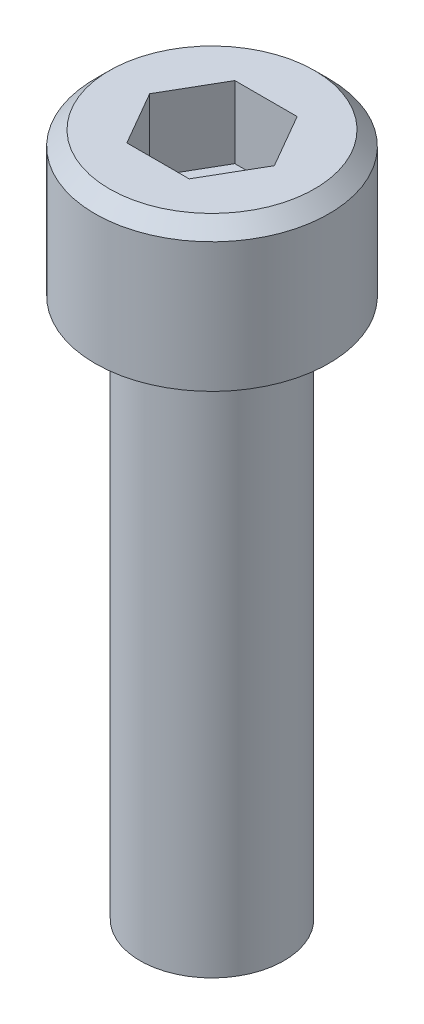
ISO-10303-21;
HEADER;
FILE_DESCRIPTION(('STEP AP214'),'2;1');
FILE_NAME('part.step','',(''),(''),'','','');
FILE_SCHEMA(('AUTOMOTIVE_DESIGN { 1 0 10303 214 1 1 1 1 }'));
ENDSEC;
DATA;
#1=APPLICATION_CONTEXT('core data for automotive mechanical design processes');
#2=APPLICATION_PROTOCOL_DEFINITION('international standard','automotive_design',2000,#1);
#3=PRODUCT_CONTEXT('',#1,'mechanical');
#4=PRODUCT('Part','Part','',(#3));
#5=PRODUCT_RELATED_PRODUCT_CATEGORY('part','',(#4));
#6=PRODUCT_DEFINITION_FORMATION('','',#4);
#7=PRODUCT_DEFINITION_CONTEXT('part definition',#1,'design');
#8=PRODUCT_DEFINITION('design','',#6,#7);
#9=PRODUCT_DEFINITION_SHAPE('','',#8);
#10=(LENGTH_UNIT() NAMED_UNIT(*) SI_UNIT(.MILLI.,.METRE.));
#11=(NAMED_UNIT(*) PLANE_ANGLE_UNIT() SI_UNIT($,.RADIAN.));
#12=(NAMED_UNIT(*) SI_UNIT($,.STERADIAN.) SOLID_ANGLE_UNIT());
#13=UNCERTAINTY_MEASURE_WITH_UNIT(LENGTH_MEASURE(1.E-05),#10,'distance_accuracy_value','');
#14=(GEOMETRIC_REPRESENTATION_CONTEXT(3) GLOBAL_UNCERTAINTY_ASSIGNED_CONTEXT((#13)) GLOBAL_UNIT_ASSIGNED_CONTEXT((#10,
#11,#12)) REPRESENTATION_CONTEXT('',''));
#15=CARTESIAN_POINT('',(0.,0.,0.));
#16=DIRECTION('',(0.,0.,1.));
#17=DIRECTION('',(1.,0.,0.));
#18=AXIS2_PLACEMENT_3D('',#15,#16,#17);
#19=CARTESIAN_POINT('',(0.,-30.,0.));
#20=DIRECTION('',(0.,-1.,0.));
#21=DIRECTION('',(0.,0.,-1.));
#22=AXIS2_PLACEMENT_3D('',#19,#20,#21);
#23=PLANE('',#22);
#24=CARTESIAN_POINT('',(0.,-30.,0.));
#25=DIRECTION('',(0.,-1.,0.));
#26=DIRECTION('',(0.,0.,-1.));
#27=AXIS2_PLACEMENT_3D('',#24,#25,#26);
#28=CIRCLE('',#27,4.);
#29=CARTESIAN_POINT('',(0.,-30.,-4.));
#30=VERTEX_POINT('',#29);
#31=EDGE_CURVE('E187',#30,#30,#28,.T.);
#32=ORIENTED_EDGE('',*,*,#31,.T.);
#33=EDGE_LOOP('',(#32));
#34=FACE_BOUND('',#33,.T.);
#35=ADVANCED_FACE('F43',(#34),#23,.T.);
#36=CARTESIAN_POINT('',(0.,0.,0.));
#37=DIRECTION('',(0.,-1.,0.));
#38=DIRECTION('',(0.,0.,-1.));
#39=AXIS2_PLACEMENT_3D('',#36,#37,#38);
#40=CYLINDRICAL_SURFACE('',#39,4.);
#41=CARTESIAN_POINT('',(0.,0.,0.));
#42=DIRECTION('',(0.,-1.,0.));
#43=DIRECTION('',(0.,0.,-1.));
#44=AXIS2_PLACEMENT_3D('',#41,#42,#43);
#45=CIRCLE('',#44,4.);
#46=CARTESIAN_POINT('',(0.,0.,-4.));
#47=VERTEX_POINT('',#46);
#48=EDGE_CURVE('E183',#47,#47,#45,.T.);
#49=ORIENTED_EDGE('',*,*,#48,.T.);
#50=EDGE_LOOP('',(#49));
#51=FACE_BOUND('',#50,.T.);
#52=ORIENTED_EDGE('',*,*,#31,.F.);
#53=EDGE_LOOP('',(#52));
#54=FACE_BOUND('',#53,.T.);
#55=ADVANCED_FACE('F206',(#51,#54),#40,.T.);
#56=CARTESIAN_POINT('',(6.5,0.,0.));
#57=DIRECTION('',(0.,-1.,0.));
#58=DIRECTION('',(0.,0.,-1.));
#59=AXIS2_PLACEMENT_3D('',#56,#57,#58);
#60=PLANE('',#59);
#61=CARTESIAN_POINT('',(0.,0.,0.));
#62=DIRECTION('',(0.,-1.,0.));
#63=DIRECTION('',(0.,0.,-1.));
#64=AXIS2_PLACEMENT_3D('',#61,#62,#63);
#65=CIRCLE('',#64,6.5);
#66=CARTESIAN_POINT('',(0.,0.,-6.5));
#67=VERTEX_POINT('',#66);
#68=EDGE_CURVE('E171',#67,#67,#65,.T.);
#69=ORIENTED_EDGE('',*,*,#68,.T.);
#70=EDGE_LOOP('',(#69));
#71=FACE_BOUND('',#70,.T.);
#72=ORIENTED_EDGE('',*,*,#48,.F.);
#73=EDGE_LOOP('',(#72));
#74=FACE_BOUND('',#73,.T.);
#75=ADVANCED_FACE('F211',(#71,#74),#60,.T.);
#76=CARTESIAN_POINT('',(0.,0.,0.));
#77=DIRECTION('',(0.,-1.,0.));
#78=DIRECTION('',(0.,0.,-1.));
#79=AXIS2_PLACEMENT_3D('',#76,#77,#78);
#80=CYLINDRICAL_SURFACE('',#79,6.5);
#81=CARTESIAN_POINT('',(0.,7.2,0.));
#82=DIRECTION('',(0.,1.,0.));
#83=DIRECTION('',(0.,0.,1.));
#84=AXIS2_PLACEMENT_3D('',#81,#82,#83);
#85=CIRCLE('',#84,6.5);
#86=CARTESIAN_POINT('',(0.,7.2,6.5));
#87=VERTEX_POINT('',#86);
#88=EDGE_CURVE('E52',#87,#87,#85,.F.);
#89=ORIENTED_EDGE('',*,*,#88,.T.);
#90=EDGE_LOOP('',(#89));
#91=FACE_BOUND('',#90,.T.);
#92=ORIENTED_EDGE('',*,*,#68,.F.);
#93=EDGE_LOOP('',(#92));
#94=FACE_BOUND('',#93,.T.);
#95=ADVANCED_FACE('F194',(#91,#94),#80,.T.);
#96=CARTESIAN_POINT('',(0.,8.,0.));
#97=DIRECTION('',(0.,1.,0.));
#98=DIRECTION('',(0.,0.,1.));
#99=AXIS2_PLACEMENT_3D('',#96,#97,#98);
#100=PLANE('',#99);
#101=CARTESIAN_POINT('',(0.,8.,0.));
#102=DIRECTION('',(0.,1.,0.));
#103=DIRECTION('',(0.,0.,1.));
#104=AXIS2_PLACEMENT_3D('',#101,#102,#103);
#105=CIRCLE('',#104,5.7);
#106=CARTESIAN_POINT('',(0.,8.,5.7));
#107=VERTEX_POINT('',#106);
#108=EDGE_CURVE('E11',#107,#107,#105,.T.);
#109=ORIENTED_EDGE('',*,*,#108,.T.);
#110=EDGE_LOOP('',(#109));
#111=FACE_BOUND('',#110,.T.);
#112=DIRECTION('',(0.5,0.,-0.866025403784439));
#113=VECTOR('',#112,1.);
#114=CARTESIAN_POINT('',(1.73205080756888,8.,3.));
#115=LINE('',#114,#113);
#116=CARTESIAN_POINT('',(1.73205080756888,8.,3.));
#117=VERTEX_POINT('',#116);
#118=CARTESIAN_POINT('',(3.46410161513776,8.,0.));
#119=VERTEX_POINT('',#118);
#120=EDGE_CURVE('E62',#117,#119,#115,.T.);
#121=ORIENTED_EDGE('',*,*,#120,.F.);
#122=DIRECTION('',(1.,0.,0.));
#123=VECTOR('',#122,1.);
#124=CARTESIAN_POINT('',(-1.73205080756887,8.,3.));
#125=LINE('',#124,#123);
#126=CARTESIAN_POINT('',(-1.73205080756887,8.,3.));
#127=VERTEX_POINT('',#126);
#128=EDGE_CURVE('E165',#127,#117,#125,.T.);
#129=ORIENTED_EDGE('',*,*,#128,.F.);
#130=DIRECTION('',(0.5,0.,0.866025403784438));
#131=VECTOR('',#130,1.);
#132=CARTESIAN_POINT('',(-3.46410161513775,8.,0.));
#133=LINE('',#132,#131);
#134=CARTESIAN_POINT('',(-3.46410161513775,8.,0.));
#135=VERTEX_POINT('',#134);
#136=EDGE_CURVE('E162',#135,#127,#133,.T.);
#137=ORIENTED_EDGE('',*,*,#136,.F.);
#138=DIRECTION('',(-0.5,0.,0.866025403784439));
#139=VECTOR('',#138,1.);
#140=CARTESIAN_POINT('',(-1.73205080756887,8.,-3.));
#141=LINE('',#140,#139);
#142=CARTESIAN_POINT('',(-1.73205080756887,8.,-3.));
#143=VERTEX_POINT('',#142);
#144=EDGE_CURVE('E119',#143,#135,#141,.T.);
#145=ORIENTED_EDGE('',*,*,#144,.F.);
#146=DIRECTION('',(-1.,0.,0.));
#147=VECTOR('',#146,1.);
#148=CARTESIAN_POINT('',(1.73205080756888,8.,-3.));
#149=LINE('',#148,#147);
#150=CARTESIAN_POINT('',(1.73205080756888,8.,-3.));
#151=VERTEX_POINT('',#150);
#152=EDGE_CURVE('E156',#151,#143,#149,.T.);
#153=ORIENTED_EDGE('',*,*,#152,.F.);
#154=DIRECTION('',(-0.5,0.,-0.866025403784438));
#155=VECTOR('',#154,1.);
#156=CARTESIAN_POINT('',(3.46410161513776,8.,0.));
#157=LINE('',#156,#155);
#158=EDGE_CURVE('E152',#119,#151,#157,.T.);
#159=ORIENTED_EDGE('',*,*,#158,.F.);
#160=EDGE_LOOP('',(#121,#129,#137,#145,#153,#159));
#161=FACE_BOUND('',#160,.T.);
#162=ADVANCED_FACE('F220',(#111,#161),#100,.T.);
#163=CARTESIAN_POINT('',(1.73205080756888,4.,3.));
#164=DIRECTION('',(0.866025403784439,0.,0.5));
#165=DIRECTION('',(0.5,0.,-0.866025403784439));
#166=AXIS2_PLACEMENT_3D('',#163,#164,#165);
#167=PLANE('',#166);
#168=ORIENTED_EDGE('',*,*,#120,.T.);
#169=DIRECTION('',(0.,1.,0.));
#170=VECTOR('',#169,1.);
#171=CARTESIAN_POINT('',(3.46410161513776,4.,0.));
#172=LINE('',#171,#170);
#173=CARTESIAN_POINT('',(3.46410161513776,4.,0.));
#174=VERTEX_POINT('',#173);
#175=EDGE_CURVE('E98',#174,#119,#172,.T.);
#176=ORIENTED_EDGE('',*,*,#175,.F.);
#177=DIRECTION('',(0.5,0.,-0.866025403784439));
#178=VECTOR('',#177,1.);
#179=CARTESIAN_POINT('',(1.73205080756888,4.,3.));
#180=LINE('',#179,#178);
#181=CARTESIAN_POINT('',(1.73205080756888,4.,3.));
#182=VERTEX_POINT('',#181);
#183=EDGE_CURVE('E168',#182,#174,#180,.T.);
#184=ORIENTED_EDGE('',*,*,#183,.F.);
#185=DIRECTION('',(0.,1.,0.));
#186=VECTOR('',#185,1.);
#187=CARTESIAN_POINT('',(1.73205080756888,4.,3.));
#188=LINE('',#187,#186);
#189=EDGE_CURVE('E72',#182,#117,#188,.T.);
#190=ORIENTED_EDGE('',*,*,#189,.T.);
#191=EDGE_LOOP('',(#168,#176,#184,#190));
#192=FACE_BOUND('',#191,.T.);
#193=ADVANCED_FACE('F223',(#192),#167,.F.);
#194=CARTESIAN_POINT('',(-1.73205080756887,4.,3.));
#195=DIRECTION('',(0.,0.,1.));
#196=DIRECTION('',(1.,0.,0.));
#197=AXIS2_PLACEMENT_3D('',#194,#195,#196);
#198=PLANE('',#197);
#199=ORIENTED_EDGE('',*,*,#128,.T.);
#200=ORIENTED_EDGE('',*,*,#189,.F.);
#201=DIRECTION('',(1.,0.,0.));
#202=VECTOR('',#201,1.);
#203=CARTESIAN_POINT('',(-1.73205080756887,4.,3.));
#204=LINE('',#203,#202);
#205=CARTESIAN_POINT('',(-1.73205080756887,4.,3.));
#206=VERTEX_POINT('',#205);
#207=EDGE_CURVE('E133',#206,#182,#204,.T.);
#208=ORIENTED_EDGE('',*,*,#207,.F.);
#209=DIRECTION('',(0.,1.,0.));
#210=VECTOR('',#209,1.);
#211=CARTESIAN_POINT('',(-1.73205080756887,4.,3.));
#212=LINE('',#211,#210);
#213=EDGE_CURVE('E124',#206,#127,#212,.T.);
#214=ORIENTED_EDGE('',*,*,#213,.T.);
#215=EDGE_LOOP('',(#199,#200,#208,#214));
#216=FACE_BOUND('',#215,.T.);
#217=ADVANCED_FACE('F227',(#216),#198,.F.);
#218=CARTESIAN_POINT('',(-3.46410161513775,4.,0.));
#219=DIRECTION('',(-0.866025403784439,0.,0.5));
#220=DIRECTION('',(0.5,0.,0.866025403784438));
#221=AXIS2_PLACEMENT_3D('',#218,#219,#220);
#222=PLANE('',#221);
#223=ORIENTED_EDGE('',*,*,#136,.T.);
#224=ORIENTED_EDGE('',*,*,#213,.F.);
#225=DIRECTION('',(0.5,0.,0.866025403784438));
#226=VECTOR('',#225,1.);
#227=CARTESIAN_POINT('',(-3.46410161513775,4.,0.));
#228=LINE('',#227,#226);
#229=CARTESIAN_POINT('',(-3.46410161513775,4.,0.));
#230=VERTEX_POINT('',#229);
#231=EDGE_CURVE('E128',#230,#206,#228,.T.);
#232=ORIENTED_EDGE('',*,*,#231,.F.);
#233=DIRECTION('',(0.,1.,0.));
#234=VECTOR('',#233,1.);
#235=CARTESIAN_POINT('',(-3.46410161513775,4.,0.));
#236=LINE('',#235,#234);
#237=EDGE_CURVE('E112',#230,#135,#236,.T.);
#238=ORIENTED_EDGE('',*,*,#237,.T.);
#239=EDGE_LOOP('',(#223,#224,#232,#238));
#240=FACE_BOUND('',#239,.T.);
#241=ADVANCED_FACE('F129',(#240),#222,.F.);
#242=CARTESIAN_POINT('',(-1.73205080756887,4.,-3.));
#243=DIRECTION('',(-0.866025403784439,0.,-0.5));
#244=DIRECTION('',(-0.5,0.,0.866025403784439));
#245=AXIS2_PLACEMENT_3D('',#242,#243,#244);
#246=PLANE('',#245);
#247=ORIENTED_EDGE('',*,*,#144,.T.);
#248=ORIENTED_EDGE('',*,*,#237,.F.);
#249=DIRECTION('',(-0.5,0.,0.866025403784439));
#250=VECTOR('',#249,1.);
#251=CARTESIAN_POINT('',(-1.73205080756887,4.,-3.));
#252=LINE('',#251,#250);
#253=CARTESIAN_POINT('',(-1.73205080756887,4.,-3.));
#254=VERTEX_POINT('',#253);
#255=EDGE_CURVE('E116',#254,#230,#252,.T.);
#256=ORIENTED_EDGE('',*,*,#255,.F.);
#257=DIRECTION('',(0.,1.,0.));
#258=VECTOR('',#257,1.);
#259=CARTESIAN_POINT('',(-1.73205080756887,4.,-3.));
#260=LINE('',#259,#258);
#261=EDGE_CURVE('E125',#254,#143,#260,.T.);
#262=ORIENTED_EDGE('',*,*,#261,.T.);
#263=EDGE_LOOP('',(#247,#248,#256,#262));
#264=FACE_BOUND('',#263,.T.);
#265=ADVANCED_FACE('F114',(#264),#246,.F.);
#266=CARTESIAN_POINT('',(1.73205080756888,4.,-3.));
#267=DIRECTION('',(0.,0.,-1.));
#268=DIRECTION('',(-1.,0.,0.));
#269=AXIS2_PLACEMENT_3D('',#266,#267,#268);
#270=PLANE('',#269);
#271=ORIENTED_EDGE('',*,*,#152,.T.);
#272=ORIENTED_EDGE('',*,*,#261,.F.);
#273=DIRECTION('',(-1.,0.,0.));
#274=VECTOR('',#273,1.);
#275=CARTESIAN_POINT('',(1.73205080756888,4.,-3.));
#276=LINE('',#275,#274);
#277=CARTESIAN_POINT('',(1.73205080756888,4.,-3.));
#278=VERTEX_POINT('',#277);
#279=EDGE_CURVE('E139',#278,#254,#276,.T.);
#280=ORIENTED_EDGE('',*,*,#279,.F.);
#281=DIRECTION('',(0.,1.,0.));
#282=VECTOR('',#281,1.);
#283=CARTESIAN_POINT('',(1.73205080756888,4.,-3.));
#284=LINE('',#283,#282);
#285=EDGE_CURVE('E175',#278,#151,#284,.T.);
#286=ORIENTED_EDGE('',*,*,#285,.T.);
#287=EDGE_LOOP('',(#271,#272,#280,#286));
#288=FACE_BOUND('',#287,.T.);
#289=ADVANCED_FACE('F230',(#288),#270,.F.);
#290=CARTESIAN_POINT('',(3.46410161513776,4.,0.));
#291=DIRECTION('',(0.866025403784438,0.,-0.5));
#292=DIRECTION('',(-0.5,0.,-0.866025403784439));
#293=AXIS2_PLACEMENT_3D('',#290,#291,#292);
#294=PLANE('',#293);
#295=ORIENTED_EDGE('',*,*,#158,.T.);
#296=ORIENTED_EDGE('',*,*,#285,.F.);
#297=DIRECTION('',(-0.5,0.,-0.866025403784438));
#298=VECTOR('',#297,1.);
#299=CARTESIAN_POINT('',(3.46410161513776,4.,0.));
#300=LINE('',#299,#298);
#301=EDGE_CURVE('E144',#174,#278,#300,.T.);
#302=ORIENTED_EDGE('',*,*,#301,.F.);
#303=ORIENTED_EDGE('',*,*,#175,.T.);
#304=EDGE_LOOP('',(#295,#296,#302,#303));
#305=FACE_BOUND('',#304,.T.);
#306=ADVANCED_FACE('F202',(#305),#294,.F.);
#307=CARTESIAN_POINT('',(0.,4.,0.));
#308=DIRECTION('',(0.,1.,0.));
#309=DIRECTION('',(0.,0.,1.));
#310=AXIS2_PLACEMENT_3D('',#307,#308,#309);
#311=PLANE('',#310);
#312=ORIENTED_EDGE('',*,*,#183,.T.);
#313=ORIENTED_EDGE('',*,*,#301,.T.);
#314=ORIENTED_EDGE('',*,*,#279,.T.);
#315=ORIENTED_EDGE('',*,*,#255,.T.);
#316=ORIENTED_EDGE('',*,*,#231,.T.);
#317=ORIENTED_EDGE('',*,*,#207,.T.);
#318=EDGE_LOOP('',(#312,#313,#314,#315,#316,#317));
#319=FACE_BOUND('',#318,.T.);
#320=ADVANCED_FACE('F136',(#319),#311,.T.);
#321=CARTESIAN_POINT('',(0.,7.2,0.));
#322=DIRECTION('',(0.,-1.,0.));
#323=DIRECTION('',(0.,0.,-1.));
#324=AXIS2_PLACEMENT_3D('',#321,#322,#323);
#325=CONICAL_SURFACE('',#324,6.5,0.785398163397452);
#326=ORIENTED_EDGE('',*,*,#108,.F.);
#327=EDGE_LOOP('',(#326));
#328=FACE_BOUND('',#327,.T.);
#329=ORIENTED_EDGE('',*,*,#88,.F.);
#330=EDGE_LOOP('',(#329));
#331=FACE_BOUND('',#330,.T.);
#332=ADVANCED_FACE('F45',(#328,#331),#325,.T.);
#333=CLOSED_SHELL('',(#35,#55,#75,#95,#162,#193,#217,#241,#265,#289,#306,#320,#332));
#334=MANIFOLD_SOLID_BREP('B2',#333);
#335=ADVANCED_BREP_SHAPE_REPRESENTATION('',(#18,#334),#14);
#336=SHAPE_DEFINITION_REPRESENTATION(#9,#335);
ENDSEC;
END-ISO-10303-21;
